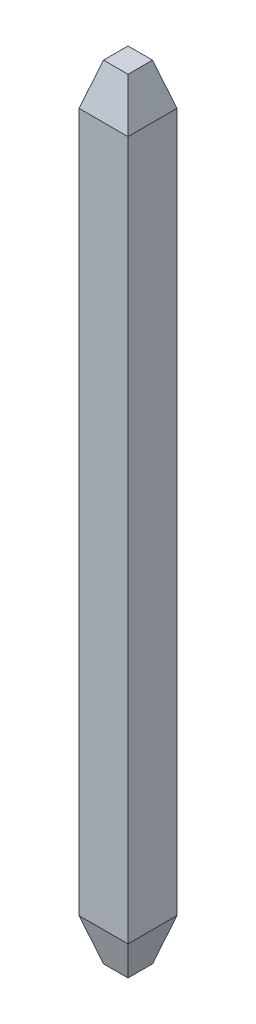
ISO-10303-21;
HEADER;
FILE_DESCRIPTION(('STEP AP214'),'2;1');
FILE_NAME('part.step','',(''),(''),'','','');
FILE_SCHEMA(('AUTOMOTIVE_DESIGN { 1 0 10303 214 1 1 1 1 }'));
ENDSEC;
DATA;
#1=APPLICATION_CONTEXT('core data for automotive mechanical design processes');
#2=APPLICATION_PROTOCOL_DEFINITION('international standard','automotive_design',2000,#1);
#3=PRODUCT_CONTEXT('',#1,'mechanical');
#4=PRODUCT('Part','Part','',(#3));
#5=PRODUCT_RELATED_PRODUCT_CATEGORY('part','',(#4));
#6=PRODUCT_DEFINITION_FORMATION('','',#4);
#7=PRODUCT_DEFINITION_CONTEXT('part definition',#1,'design');
#8=PRODUCT_DEFINITION('design','',#6,#7);
#9=PRODUCT_DEFINITION_SHAPE('','',#8);
#10=(LENGTH_UNIT() NAMED_UNIT(*) SI_UNIT(.MILLI.,.METRE.));
#11=(NAMED_UNIT(*) PLANE_ANGLE_UNIT() SI_UNIT($,.RADIAN.));
#12=(NAMED_UNIT(*) SI_UNIT($,.STERADIAN.) SOLID_ANGLE_UNIT());
#13=UNCERTAINTY_MEASURE_WITH_UNIT(LENGTH_MEASURE(1.E-05),#10,'distance_accuracy_value','');
#14=(GEOMETRIC_REPRESENTATION_CONTEXT(3) GLOBAL_UNCERTAINTY_ASSIGNED_CONTEXT((#13)) GLOBAL_UNIT_ASSIGNED_CONTEXT((#10,
#11,#12)) REPRESENTATION_CONTEXT('',''));
#15=CARTESIAN_POINT('',(0.,0.,0.));
#16=DIRECTION('',(0.,0.,1.));
#17=DIRECTION('',(1.,0.,0.));
#18=AXIS2_PLACEMENT_3D('',#15,#16,#17);
#19=CARTESIAN_POINT('',(-18.569999999987,-0.965870106912721,-19.5199999999763));
#20=DIRECTION('',(0.959644900900968,0.281214622974643,0.));
#21=DIRECTION('',(0.,0.,-1.));
#22=AXIS2_PLACEMENT_3D('',#19,#20,#21);
#23=PLANE('',#22);
#24=DIRECTION('',(-0.270714017147727,0.923811583516617,0.270714017147727));
#25=VECTOR('',#24,1.);
#26=CARTESIAN_POINT('',(-18.569999999987,-0.965870106912721,-19.8399999999763));
#27=LINE('',#26,#25);
#28=CARTESIAN_POINT('',(-18.569999999987,-0.965870106912723,-19.8399999999763));
#29=VERTEX_POINT('',#28);
#30=CARTESIAN_POINT('',(-18.729999999987,-0.419870106912724,-19.6799999999763));
#31=VERTEX_POINT('',#30);
#32=EDGE_CURVE('E11',#29,#31,#27,.T.);
#33=ORIENTED_EDGE('',*,*,#32,.T.);
#34=DIRECTION('',(0.,0.,1.));
#35=VECTOR('',#34,1.);
#36=CARTESIAN_POINT('',(-18.729999999987,-0.419870106912722,-19.6799999999763));
#37=LINE('',#36,#35);
#38=CARTESIAN_POINT('',(-18.729999999987,-0.419870106912724,-19.3599999999763));
#39=VERTEX_POINT('',#38);
#40=EDGE_CURVE('E28',#31,#39,#37,.T.);
#41=ORIENTED_EDGE('',*,*,#40,.T.);
#42=DIRECTION('',(-0.270714017147727,0.923811583516617,-0.270714017147727));
#43=VECTOR('',#42,1.);
#44=CARTESIAN_POINT('',(-18.569999999987,-0.965870106912721,-19.1999999999763));
#45=LINE('',#44,#43);
#46=CARTESIAN_POINT('',(-18.569999999987,-0.965870106912723,-19.1999999999763));
#47=VERTEX_POINT('',#46);
#48=EDGE_CURVE('E152',#47,#39,#45,.T.);
#49=ORIENTED_EDGE('',*,*,#48,.F.);
#50=DIRECTION('',(0.,0.,1.));
#51=VECTOR('',#50,1.);
#52=CARTESIAN_POINT('',(-18.569999999987,-0.965870106912721,-19.8399999999763));
#53=LINE('',#52,#51);
#54=EDGE_CURVE('E174',#29,#47,#53,.T.);
#55=ORIENTED_EDGE('',*,*,#54,.F.);
#56=EDGE_LOOP('',(#33,#41,#49,#55));
#57=FACE_BOUND('',#56,.T.);
#58=ADVANCED_FACE('F17',(#57),#23,.T.);
#59=CARTESIAN_POINT('',(-18.889999999987,-0.965870106912721,-19.8399999999763));
#60=DIRECTION('',(0.,0.281214622974643,-0.959644900900968));
#61=DIRECTION('',(-1.,0.,0.));
#62=AXIS2_PLACEMENT_3D('',#59,#60,#61);
#63=PLANE('',#62);
#64=DIRECTION('',(0.270714017147727,0.923811583516617,0.270714017147727));
#65=VECTOR('',#64,1.);
#66=CARTESIAN_POINT('',(-19.209999999987,-0.965870106912721,-19.8399999999763));
#67=LINE('',#66,#65);
#68=CARTESIAN_POINT('',(-19.209999999987,-0.965870106912723,-19.8399999999763));
#69=VERTEX_POINT('',#68);
#70=CARTESIAN_POINT('',(-19.049999999987,-0.419870106912724,-19.6799999999763));
#71=VERTEX_POINT('',#70);
#72=EDGE_CURVE('E164',#69,#71,#67,.T.);
#73=ORIENTED_EDGE('',*,*,#72,.T.);
#74=DIRECTION('',(1.,0.,0.));
#75=VECTOR('',#74,1.);
#76=CARTESIAN_POINT('',(-19.049999999987,-0.419870106912722,-19.6799999999763));
#77=LINE('',#76,#75);
#78=EDGE_CURVE('E156',#71,#31,#77,.T.);
#79=ORIENTED_EDGE('',*,*,#78,.T.);
#80=ORIENTED_EDGE('',*,*,#32,.F.);
#81=DIRECTION('',(1.,0.,0.));
#82=VECTOR('',#81,1.);
#83=CARTESIAN_POINT('',(-19.209999999987,-0.965870106912721,-19.8399999999763));
#84=LINE('',#83,#82);
#85=EDGE_CURVE('E206',#69,#29,#84,.T.);
#86=ORIENTED_EDGE('',*,*,#85,.F.);
#87=EDGE_LOOP('',(#73,#79,#80,#86));
#88=FACE_BOUND('',#87,.T.);
#89=ADVANCED_FACE('F19',(#88),#63,.T.);
#90=CARTESIAN_POINT('',(-19.209999999987,-0.965870106912721,-19.5199999999763));
#91=DIRECTION('',(-0.959644900900968,0.281214622974643,0.));
#92=DIRECTION('',(0.,0.,1.));
#93=AXIS2_PLACEMENT_3D('',#90,#91,#92);
#94=PLANE('',#93);
#95=DIRECTION('',(0.270714017147727,0.923811583516617,-0.270714017147727));
#96=VECTOR('',#95,1.);
#97=CARTESIAN_POINT('',(-19.209999999987,-0.965870106912721,-19.1999999999763));
#98=LINE('',#97,#96);
#99=CARTESIAN_POINT('',(-19.209999999987,-0.965870106912723,-19.1999999999763));
#100=VERTEX_POINT('',#99);
#101=CARTESIAN_POINT('',(-19.049999999987,-0.419870106912724,-19.3599999999763));
#102=VERTEX_POINT('',#101);
#103=EDGE_CURVE('E153',#100,#102,#98,.T.);
#104=ORIENTED_EDGE('',*,*,#103,.T.);
#105=DIRECTION('',(0.,0.,-1.));
#106=VECTOR('',#105,1.);
#107=CARTESIAN_POINT('',(-19.049999999987,-0.419870106912722,-19.3599999999763));
#108=LINE('',#107,#106);
#109=EDGE_CURVE('E132',#102,#71,#108,.T.);
#110=ORIENTED_EDGE('',*,*,#109,.T.);
#111=ORIENTED_EDGE('',*,*,#72,.F.);
#112=DIRECTION('',(0.,0.,-1.));
#113=VECTOR('',#112,1.);
#114=CARTESIAN_POINT('',(-19.209999999987,-0.965870106912721,-19.1999999999763));
#115=LINE('',#114,#113);
#116=EDGE_CURVE('E21',#100,#69,#115,.T.);
#117=ORIENTED_EDGE('',*,*,#116,.F.);
#118=EDGE_LOOP('',(#104,#110,#111,#117));
#119=FACE_BOUND('',#118,.T.);
#120=ADVANCED_FACE('F232',(#119),#94,.T.);
#121=CARTESIAN_POINT('',(-19.209999999987,-5.53543505344796,-19.1989999999763));
#122=DIRECTION('',(-1.,0.,0.));
#123=DIRECTION('',(0.,0.,1.));
#124=AXIS2_PLACEMENT_3D('',#121,#122,#123);
#125=PLANE('',#124);
#126=DIRECTION('',(0.,1.,0.));
#127=VECTOR('',#126,1.);
#128=CARTESIAN_POINT('',(-19.209999999987,-10.1039999999832,-19.8399999999763));
#129=LINE('',#128,#127);
#130=CARTESIAN_POINT('',(-19.209999999987,-10.1039999999832,-19.8399999999763));
#131=VERTEX_POINT('',#130);
#132=EDGE_CURVE('E105',#131,#69,#129,.T.);
#133=ORIENTED_EDGE('',*,*,#132,.F.);
#134=DIRECTION('',(0.,0.,-1.));
#135=VECTOR('',#134,1.);
#136=CARTESIAN_POINT('',(-19.209999999987,-10.1039999999832,-19.1999999999763));
#137=LINE('',#136,#135);
#138=CARTESIAN_POINT('',(-19.209999999987,-10.1039999999832,-19.1999999999763));
#139=VERTEX_POINT('',#138);
#140=EDGE_CURVE('E97',#139,#131,#137,.T.);
#141=ORIENTED_EDGE('',*,*,#140,.F.);
#142=DIRECTION('',(0.,1.,0.));
#143=VECTOR('',#142,1.);
#144=CARTESIAN_POINT('',(-19.209999999987,-10.1039999999832,-19.1999999999763));
#145=LINE('',#144,#143);
#146=EDGE_CURVE('E102',#139,#100,#145,.T.);
#147=ORIENTED_EDGE('',*,*,#146,.T.);
#148=ORIENTED_EDGE('',*,*,#116,.T.);
#149=EDGE_LOOP('',(#133,#141,#147,#148));
#150=FACE_BOUND('',#149,.T.);
#151=ADVANCED_FACE('F99',(#150),#125,.T.);
#152=CARTESIAN_POINT('',(-19.210999999987,-5.53543505344796,-19.1999999999763));
#153=DIRECTION('',(0.,0.,1.));
#154=DIRECTION('',(1.,0.,0.));
#155=AXIS2_PLACEMENT_3D('',#152,#153,#154);
#156=PLANE('',#155);
#157=ORIENTED_EDGE('',*,*,#146,.F.);
#158=DIRECTION('',(-1.,0.,0.));
#159=VECTOR('',#158,1.);
#160=CARTESIAN_POINT('',(-18.569999999987,-10.1039999999832,-19.1999999999763));
#161=LINE('',#160,#159);
#162=CARTESIAN_POINT('',(-18.569999999987,-10.1039999999832,-19.1999999999763));
#163=VERTEX_POINT('',#162);
#164=EDGE_CURVE('E116',#163,#139,#161,.T.);
#165=ORIENTED_EDGE('',*,*,#164,.F.);
#166=DIRECTION('',(0.,1.,0.));
#167=VECTOR('',#166,1.);
#168=CARTESIAN_POINT('',(-18.569999999987,-10.1039999999832,-19.1999999999763));
#169=LINE('',#168,#167);
#170=EDGE_CURVE('E213',#163,#47,#169,.T.);
#171=ORIENTED_EDGE('',*,*,#170,.T.);
#172=DIRECTION('',(-1.,0.,0.));
#173=VECTOR('',#172,1.);
#174=CARTESIAN_POINT('',(-18.569999999987,-0.965870106912721,-19.1999999999763));
#175=LINE('',#174,#173);
#176=EDGE_CURVE('E126',#47,#100,#175,.T.);
#177=ORIENTED_EDGE('',*,*,#176,.T.);
#178=EDGE_LOOP('',(#157,#165,#171,#177));
#179=FACE_BOUND('',#178,.T.);
#180=ADVANCED_FACE('F129',(#179),#156,.T.);
#181=CARTESIAN_POINT('',(-18.889999999987,-10.1039999999832,-19.1999999999763));
#182=DIRECTION('',(0.,-0.281214622974643,0.959644900900968));
#183=DIRECTION('',(-1.,0.,0.));
#184=AXIS2_PLACEMENT_3D('',#181,#182,#183);
#185=PLANE('',#184);
#186=ORIENTED_EDGE('',*,*,#164,.T.);
#187=DIRECTION('',(0.270714017147727,-0.923811583516618,-0.270714017147727));
#188=VECTOR('',#187,1.);
#189=CARTESIAN_POINT('',(-19.209999999987,-10.1039999999832,-19.1999999999763));
#190=LINE('',#189,#188);
#191=CARTESIAN_POINT('',(-19.049999999987,-10.6499999999832,-19.3599999999763));
#192=VERTEX_POINT('',#191);
#193=EDGE_CURVE('E118',#139,#192,#190,.T.);
#194=ORIENTED_EDGE('',*,*,#193,.T.);
#195=DIRECTION('',(-1.,0.,0.));
#196=VECTOR('',#195,1.);
#197=CARTESIAN_POINT('',(-18.729999999987,-10.6499999999832,-19.3599999999763));
#198=LINE('',#197,#196);
#199=CARTESIAN_POINT('',(-18.729999999987,-10.6499999999832,-19.3599999999763));
#200=VERTEX_POINT('',#199);
#201=EDGE_CURVE('E180',#200,#192,#198,.T.);
#202=ORIENTED_EDGE('',*,*,#201,.F.);
#203=DIRECTION('',(-0.270714017147727,-0.923811583516618,-0.270714017147727));
#204=VECTOR('',#203,1.);
#205=CARTESIAN_POINT('',(-18.569999999987,-10.1039999999832,-19.1999999999763));
#206=LINE('',#205,#204);
#207=EDGE_CURVE('E121',#163,#200,#206,.T.);
#208=ORIENTED_EDGE('',*,*,#207,.F.);
#209=EDGE_LOOP('',(#186,#194,#202,#208));
#210=FACE_BOUND('',#209,.T.);
#211=ADVANCED_FACE('F117',(#210),#185,.T.);
#212=CARTESIAN_POINT('',(-18.569999999987,-10.1039999999832,-19.5199999999763));
#213=DIRECTION('',(0.959644900900968,-0.281214622974643,0.));
#214=DIRECTION('',(0.,0.,-1.));
#215=AXIS2_PLACEMENT_3D('',#212,#213,#214);
#216=PLANE('',#215);
#217=DIRECTION('',(0.,0.,1.));
#218=VECTOR('',#217,1.);
#219=CARTESIAN_POINT('',(-18.569999999987,-10.1039999999832,-19.8399999999763));
#220=LINE('',#219,#218);
#221=CARTESIAN_POINT('',(-18.569999999987,-10.1039999999832,-19.8399999999763));
#222=VERTEX_POINT('',#221);
#223=EDGE_CURVE('E137',#222,#163,#220,.T.);
#224=ORIENTED_EDGE('',*,*,#223,.T.);
#225=ORIENTED_EDGE('',*,*,#207,.T.);
#226=DIRECTION('',(0.,0.,1.));
#227=VECTOR('',#226,1.);
#228=CARTESIAN_POINT('',(-18.729999999987,-10.6499999999832,-19.6799999999763));
#229=LINE('',#228,#227);
#230=CARTESIAN_POINT('',(-18.729999999987,-10.6499999999832,-19.6799999999763));
#231=VERTEX_POINT('',#230);
#232=EDGE_CURVE('E175',#231,#200,#229,.T.);
#233=ORIENTED_EDGE('',*,*,#232,.F.);
#234=DIRECTION('',(-0.270714017147727,-0.923811583516618,0.270714017147727));
#235=VECTOR('',#234,1.);
#236=CARTESIAN_POINT('',(-18.569999999987,-10.1039999999832,-19.8399999999763));
#237=LINE('',#236,#235);
#238=EDGE_CURVE('E179',#222,#231,#237,.T.);
#239=ORIENTED_EDGE('',*,*,#238,.F.);
#240=EDGE_LOOP('',(#224,#225,#233,#239));
#241=FACE_BOUND('',#240,.T.);
#242=ADVANCED_FACE('F318',(#241),#216,.T.);
#243=CARTESIAN_POINT('',(-18.889999999987,-10.1039999999832,-19.8399999999763));
#244=DIRECTION('',(0.,-0.281214622974643,-0.959644900900968));
#245=DIRECTION('',(0.,-0.959644900900968,0.281214622974643));
#246=AXIS2_PLACEMENT_3D('',#243,#244,#245);
#247=PLANE('',#246);
#248=DIRECTION('',(1.,0.,0.));
#249=VECTOR('',#248,1.);
#250=CARTESIAN_POINT('',(-19.209999999987,-10.1039999999832,-19.8399999999763));
#251=LINE('',#250,#249);
#252=EDGE_CURVE('E187',#131,#222,#251,.T.);
#253=ORIENTED_EDGE('',*,*,#252,.T.);
#254=ORIENTED_EDGE('',*,*,#238,.T.);
#255=DIRECTION('',(1.,0.,0.));
#256=VECTOR('',#255,1.);
#257=CARTESIAN_POINT('',(-19.049999999987,-10.6499999999832,-19.6799999999763));
#258=LINE('',#257,#256);
#259=CARTESIAN_POINT('',(-19.049999999987,-10.6499999999832,-19.6799999999763));
#260=VERTEX_POINT('',#259);
#261=EDGE_CURVE('E110',#260,#231,#258,.T.);
#262=ORIENTED_EDGE('',*,*,#261,.F.);
#263=DIRECTION('',(0.270714017147727,-0.923811583516618,0.270714017147727));
#264=VECTOR('',#263,1.);
#265=CARTESIAN_POINT('',(-19.209999999987,-10.1039999999832,-19.8399999999763));
#266=LINE('',#265,#264);
#267=EDGE_CURVE('E111',#131,#260,#266,.T.);
#268=ORIENTED_EDGE('',*,*,#267,.F.);
#269=EDGE_LOOP('',(#253,#254,#262,#268));
#270=FACE_BOUND('',#269,.T.);
#271=ADVANCED_FACE('F309',(#270),#247,.T.);
#272=CARTESIAN_POINT('',(-19.050999999987,-10.6499999999832,-19.5199999999763));
#273=DIRECTION('',(0.,-1.,0.));
#274=DIRECTION('',(0.,0.,-1.));
#275=AXIS2_PLACEMENT_3D('',#272,#273,#274);
#276=PLANE('',#275);
#277=ORIENTED_EDGE('',*,*,#232,.T.);
#278=ORIENTED_EDGE('',*,*,#201,.T.);
#279=DIRECTION('',(0.,0.,-1.));
#280=VECTOR('',#279,1.);
#281=CARTESIAN_POINT('',(-19.049999999987,-10.6499999999832,-19.3599999999763));
#282=LINE('',#281,#280);
#283=EDGE_CURVE('E135',#192,#260,#282,.T.);
#284=ORIENTED_EDGE('',*,*,#283,.T.);
#285=ORIENTED_EDGE('',*,*,#261,.T.);
#286=EDGE_LOOP('',(#277,#278,#284,#285));
#287=FACE_BOUND('',#286,.T.);
#288=ADVANCED_FACE('F304',(#287),#276,.T.);
#289=CARTESIAN_POINT('',(-19.209999999987,-10.1039999999832,-19.5199999999763));
#290=DIRECTION('',(-0.959644900900968,-0.281214622974643,0.));
#291=DIRECTION('',(-0.281214622974643,0.959644900900968,0.));
#292=AXIS2_PLACEMENT_3D('',#289,#290,#291);
#293=PLANE('',#292);
#294=ORIENTED_EDGE('',*,*,#140,.T.);
#295=ORIENTED_EDGE('',*,*,#267,.T.);
#296=ORIENTED_EDGE('',*,*,#283,.F.);
#297=ORIENTED_EDGE('',*,*,#193,.F.);
#298=EDGE_LOOP('',(#294,#295,#296,#297));
#299=FACE_BOUND('',#298,.T.);
#300=ADVANCED_FACE('F133',(#299),#293,.T.);
#301=CARTESIAN_POINT('',(-18.568999999987,-5.53443505344796,-19.8399999999763));
#302=DIRECTION('',(0.,0.,-1.));
#303=DIRECTION('',(0.,-1.,0.));
#304=AXIS2_PLACEMENT_3D('',#301,#302,#303);
#305=PLANE('',#304);
#306=DIRECTION('',(0.,1.,0.));
#307=VECTOR('',#306,1.);
#308=CARTESIAN_POINT('',(-18.569999999987,-10.1039999999832,-19.8399999999763));
#309=LINE('',#308,#307);
#310=EDGE_CURVE('E202',#222,#29,#309,.T.);
#311=ORIENTED_EDGE('',*,*,#310,.F.);
#312=ORIENTED_EDGE('',*,*,#252,.F.);
#313=ORIENTED_EDGE('',*,*,#132,.T.);
#314=ORIENTED_EDGE('',*,*,#85,.T.);
#315=EDGE_LOOP('',(#311,#312,#313,#314));
#316=FACE_BOUND('',#315,.T.);
#317=ADVANCED_FACE('F234',(#316),#305,.T.);
#318=CARTESIAN_POINT('',(-18.569999999987,-11.0738701069127,-19.5199999999763));
#319=DIRECTION('',(1.,0.,0.));
#320=DIRECTION('',(0.,1.,0.));
#321=AXIS2_PLACEMENT_3D('',#318,#319,#320);
#322=PLANE('',#321);
#323=ORIENTED_EDGE('',*,*,#170,.F.);
#324=ORIENTED_EDGE('',*,*,#223,.F.);
#325=ORIENTED_EDGE('',*,*,#310,.T.);
#326=ORIENTED_EDGE('',*,*,#54,.T.);
#327=EDGE_LOOP('',(#323,#324,#325,#326));
#328=FACE_BOUND('',#327,.T.);
#329=ADVANCED_FACE('F222',(#328),#322,.T.);
#330=CARTESIAN_POINT('',(-18.889999999987,-0.965870106912721,-19.1999999999763));
#331=DIRECTION('',(0.,0.281214622974643,0.959644900900968));
#332=DIRECTION('',(1.,0.,0.));
#333=AXIS2_PLACEMENT_3D('',#330,#331,#332);
#334=PLANE('',#333);
#335=ORIENTED_EDGE('',*,*,#48,.T.);
#336=DIRECTION('',(-1.,0.,0.));
#337=VECTOR('',#336,1.);
#338=CARTESIAN_POINT('',(-18.729999999987,-0.419870106912722,-19.3599999999763));
#339=LINE('',#338,#337);
#340=EDGE_CURVE('E148',#39,#102,#339,.T.);
#341=ORIENTED_EDGE('',*,*,#340,.T.);
#342=ORIENTED_EDGE('',*,*,#103,.F.);
#343=ORIENTED_EDGE('',*,*,#176,.F.);
#344=EDGE_LOOP('',(#335,#341,#342,#343));
#345=FACE_BOUND('',#344,.T.);
#346=ADVANCED_FACE('F227',(#345),#334,.T.);
#347=CARTESIAN_POINT('',(-18.889999999987,-0.419870106912722,-19.6809999999763));
#348=DIRECTION('',(0.,1.,0.));
#349=DIRECTION('',(1.,0.,0.));
#350=AXIS2_PLACEMENT_3D('',#347,#348,#349);
#351=PLANE('',#350);
#352=ORIENTED_EDGE('',*,*,#78,.F.);
#353=ORIENTED_EDGE('',*,*,#109,.F.);
#354=ORIENTED_EDGE('',*,*,#340,.F.);
#355=ORIENTED_EDGE('',*,*,#40,.F.);
#356=EDGE_LOOP('',(#352,#353,#354,#355));
#357=FACE_BOUND('',#356,.T.);
#358=ADVANCED_FACE('F228',(#357),#351,.T.);
#359=CLOSED_SHELL('',(#58,#89,#120,#151,#180,#211,#242,#271,#288,#300,#317,#329,#346,#358));
#360=MANIFOLD_SOLID_BREP('B1',#359);
#361=ADVANCED_BREP_SHAPE_REPRESENTATION('',(#18,#360),#14);
#362=SHAPE_DEFINITION_REPRESENTATION(#9,#361);
ENDSEC;
END-ISO-10303-21;
